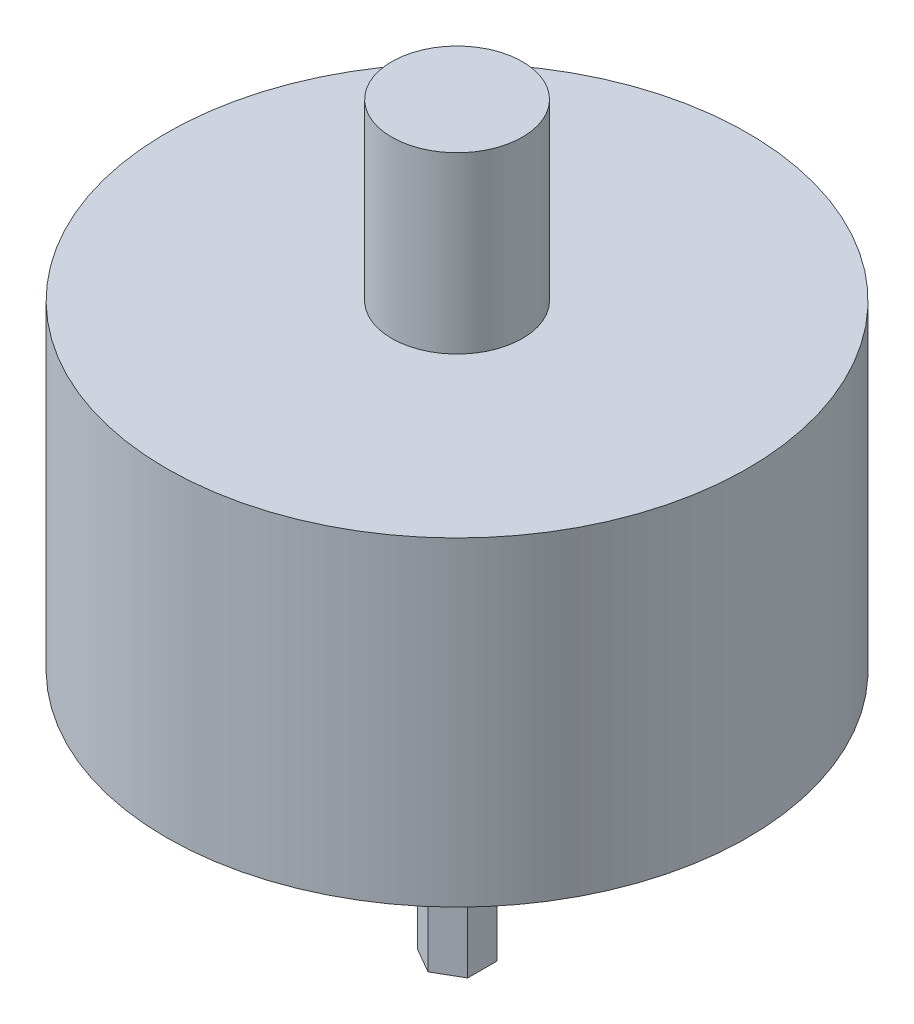
ISO-10303-21;
HEADER;
FILE_DESCRIPTION(('STEP AP214'),'2;1');
FILE_NAME('part.step','',(''),(''),'','','');
FILE_SCHEMA(('AUTOMOTIVE_DESIGN { 1 0 10303 214 1 1 1 1 }'));
ENDSEC;
DATA;
#1=APPLICATION_CONTEXT('core data for automotive mechanical design processes');
#2=APPLICATION_PROTOCOL_DEFINITION('international standard','automotive_design',2000,#1);
#3=PRODUCT_CONTEXT('',#1,'mechanical');
#4=PRODUCT('Part','Part','',(#3));
#5=PRODUCT_RELATED_PRODUCT_CATEGORY('part','',(#4));
#6=PRODUCT_DEFINITION_FORMATION('','',#4);
#7=PRODUCT_DEFINITION_CONTEXT('part definition',#1,'design');
#8=PRODUCT_DEFINITION('design','',#6,#7);
#9=PRODUCT_DEFINITION_SHAPE('','',#8);
#10=(LENGTH_UNIT() NAMED_UNIT(*) SI_UNIT(.MILLI.,.METRE.));
#11=(NAMED_UNIT(*) PLANE_ANGLE_UNIT() SI_UNIT($,.RADIAN.));
#12=(NAMED_UNIT(*) SI_UNIT($,.STERADIAN.) SOLID_ANGLE_UNIT());
#13=UNCERTAINTY_MEASURE_WITH_UNIT(LENGTH_MEASURE(1.E-05),#10,'distance_accuracy_value','');
#14=(GEOMETRIC_REPRESENTATION_CONTEXT(3) GLOBAL_UNCERTAINTY_ASSIGNED_CONTEXT((#13)) GLOBAL_UNIT_ASSIGNED_CONTEXT((#10,
#11,#12)) REPRESENTATION_CONTEXT('',''));
#15=CARTESIAN_POINT('',(0.,0.,0.));
#16=DIRECTION('',(0.,0.,1.));
#17=DIRECTION('',(1.,0.,0.));
#18=AXIS2_PLACEMENT_3D('',#15,#16,#17);
#19=CARTESIAN_POINT('',(0.866025403784438,8.5,-0.500000000000001));
#20=DIRECTION('',(-0.5,0.,0.866025403784439));
#21=DIRECTION('',(0.866025403784439,0.,0.5));
#22=AXIS2_PLACEMENT_3D('',#19,#20,#21);
#23=PLANE('',#22);
#24=DIRECTION('',(-0.866025403784439,0.,-0.5));
#25=VECTOR('',#24,1.);
#26=CARTESIAN_POINT('',(0.866025403784438,0.,-0.500000000000001));
#27=LINE('',#26,#25);
#28=CARTESIAN_POINT('',(0.866025403784438,0.,-0.500000000000001));
#29=VERTEX_POINT('',#28);
#30=CARTESIAN_POINT('',(0.,0.,-1.));
#31=VERTEX_POINT('',#30);
#32=EDGE_CURVE('E146',#29,#31,#27,.T.);
#33=ORIENTED_EDGE('',*,*,#32,.T.);
#34=DIRECTION('',(0.,-1.,0.));
#35=VECTOR('',#34,1.);
#36=CARTESIAN_POINT('',(0.,8.5,-1.));
#37=LINE('',#36,#35);
#38=CARTESIAN_POINT('',(0.,8.5,-1.));
#39=VERTEX_POINT('',#38);
#40=EDGE_CURVE('E48',#39,#31,#37,.T.);
#41=ORIENTED_EDGE('',*,*,#40,.F.);
#42=DIRECTION('',(-0.866025403784439,0.,-0.5));
#43=VECTOR('',#42,1.);
#44=CARTESIAN_POINT('',(0.866025403784438,8.5,-0.500000000000001));
#45=LINE('',#44,#43);
#46=CARTESIAN_POINT('',(0.866025403784438,8.5,-0.500000000000001));
#47=VERTEX_POINT('',#46);
#48=EDGE_CURVE('E136',#47,#39,#45,.T.);
#49=ORIENTED_EDGE('',*,*,#48,.F.);
#50=DIRECTION('',(0.,-1.,0.));
#51=VECTOR('',#50,1.);
#52=CARTESIAN_POINT('',(0.866025403784438,8.5,-0.500000000000001));
#53=LINE('',#52,#51);
#54=EDGE_CURVE('E145',#47,#29,#53,.T.);
#55=ORIENTED_EDGE('',*,*,#54,.T.);
#56=EDGE_LOOP('',(#33,#41,#49,#55));
#57=FACE_BOUND('',#56,.T.);
#58=ADVANCED_FACE('F45',(#57),#23,.F.);
#59=CARTESIAN_POINT('',(0.,8.5,-1.));
#60=DIRECTION('',(0.5,0.,0.866025403784438));
#61=DIRECTION('',(0.866025403784438,0.,-0.5));
#62=AXIS2_PLACEMENT_3D('',#59,#60,#61);
#63=PLANE('',#62);
#64=DIRECTION('',(-0.866025403784438,0.,0.5));
#65=VECTOR('',#64,1.);
#66=CARTESIAN_POINT('',(0.,0.,-1.));
#67=LINE('',#66,#65);
#68=CARTESIAN_POINT('',(-0.866025403784439,0.,-0.5));
#69=VERTEX_POINT('',#68);
#70=EDGE_CURVE('E150',#31,#69,#67,.T.);
#71=ORIENTED_EDGE('',*,*,#70,.T.);
#72=DIRECTION('',(0.,-1.,0.));
#73=VECTOR('',#72,1.);
#74=CARTESIAN_POINT('',(-0.866025403784439,8.5,-0.5));
#75=LINE('',#74,#73);
#76=CARTESIAN_POINT('',(-0.866025403784439,8.5,-0.5));
#77=VERTEX_POINT('',#76);
#78=EDGE_CURVE('E119',#77,#69,#75,.T.);
#79=ORIENTED_EDGE('',*,*,#78,.F.);
#80=DIRECTION('',(-0.866025403784438,0.,0.5));
#81=VECTOR('',#80,1.);
#82=CARTESIAN_POINT('',(0.,8.5,-1.));
#83=LINE('',#82,#81);
#84=EDGE_CURVE('E100',#39,#77,#83,.T.);
#85=ORIENTED_EDGE('',*,*,#84,.F.);
#86=ORIENTED_EDGE('',*,*,#40,.T.);
#87=EDGE_LOOP('',(#71,#79,#85,#86));
#88=FACE_BOUND('',#87,.T.);
#89=ADVANCED_FACE('F170',(#88),#63,.F.);
#90=CARTESIAN_POINT('',(-0.866025403784439,8.5,-0.5));
#91=DIRECTION('',(1.,0.,0.));
#92=DIRECTION('',(0.,0.,-1.));
#93=AXIS2_PLACEMENT_3D('',#90,#91,#92);
#94=PLANE('',#93);
#95=DIRECTION('',(0.,0.,1.));
#96=VECTOR('',#95,1.);
#97=CARTESIAN_POINT('',(-0.866025403784439,0.,-0.5));
#98=LINE('',#97,#96);
#99=CARTESIAN_POINT('',(-0.866025403784438,0.,0.5));
#100=VERTEX_POINT('',#99);
#101=EDGE_CURVE('E115',#69,#100,#98,.T.);
#102=ORIENTED_EDGE('',*,*,#101,.T.);
#103=DIRECTION('',(0.,-1.,0.));
#104=VECTOR('',#103,1.);
#105=CARTESIAN_POINT('',(-0.866025403784438,8.5,0.5));
#106=LINE('',#105,#104);
#107=CARTESIAN_POINT('',(-0.866025403784438,8.5,0.5));
#108=VERTEX_POINT('',#107);
#109=EDGE_CURVE('E108',#108,#100,#106,.T.);
#110=ORIENTED_EDGE('',*,*,#109,.F.);
#111=DIRECTION('',(0.,0.,1.));
#112=VECTOR('',#111,1.);
#113=CARTESIAN_POINT('',(-0.866025403784439,8.5,-0.5));
#114=LINE('',#113,#112);
#115=EDGE_CURVE('E113',#77,#108,#114,.T.);
#116=ORIENTED_EDGE('',*,*,#115,.F.);
#117=ORIENTED_EDGE('',*,*,#78,.T.);
#118=EDGE_LOOP('',(#102,#110,#116,#117));
#119=FACE_BOUND('',#118,.T.);
#120=ADVANCED_FACE('F110',(#119),#94,.F.);
#121=CARTESIAN_POINT('',(-0.866025403784438,8.5,0.5));
#122=DIRECTION('',(0.5,0.,-0.866025403784439));
#123=DIRECTION('',(-0.866025403784439,0.,-0.5));
#124=AXIS2_PLACEMENT_3D('',#121,#122,#123);
#125=PLANE('',#124);
#126=DIRECTION('',(0.866025403784439,0.,0.499999999999999));
#127=VECTOR('',#126,1.);
#128=CARTESIAN_POINT('',(-0.866025403784438,0.,0.5));
#129=LINE('',#128,#127);
#130=CARTESIAN_POINT('',(0.,0.,1.));
#131=VERTEX_POINT('',#130);
#132=EDGE_CURVE('E156',#100,#131,#129,.T.);
#133=ORIENTED_EDGE('',*,*,#132,.T.);
#134=DIRECTION('',(0.,-1.,0.));
#135=VECTOR('',#134,1.);
#136=CARTESIAN_POINT('',(0.,8.5,1.));
#137=LINE('',#136,#135);
#138=CARTESIAN_POINT('',(0.,8.5,1.));
#139=VERTEX_POINT('',#138);
#140=EDGE_CURVE('E120',#139,#131,#137,.T.);
#141=ORIENTED_EDGE('',*,*,#140,.F.);
#142=DIRECTION('',(0.866025403784439,0.,0.499999999999999));
#143=VECTOR('',#142,1.);
#144=CARTESIAN_POINT('',(-0.866025403784438,8.5,0.5));
#145=LINE('',#144,#143);
#146=EDGE_CURVE('E123',#108,#139,#145,.T.);
#147=ORIENTED_EDGE('',*,*,#146,.F.);
#148=ORIENTED_EDGE('',*,*,#109,.T.);
#149=EDGE_LOOP('',(#133,#141,#147,#148));
#150=FACE_BOUND('',#149,.T.);
#151=ADVANCED_FACE('F124',(#150),#125,.F.);
#152=CARTESIAN_POINT('',(0.,8.5,1.));
#153=DIRECTION('',(-0.5,0.,-0.866025403784439));
#154=DIRECTION('',(-0.866025403784439,0.,0.5));
#155=AXIS2_PLACEMENT_3D('',#152,#153,#154);
#156=PLANE('',#155);
#157=DIRECTION('',(0.866025403784439,0.,-0.5));
#158=VECTOR('',#157,1.);
#159=CARTESIAN_POINT('',(0.,0.,1.));
#160=LINE('',#159,#158);
#161=CARTESIAN_POINT('',(0.866025403784438,0.,0.500000000000001));
#162=VERTEX_POINT('',#161);
#163=EDGE_CURVE('E85',#131,#162,#160,.T.);
#164=ORIENTED_EDGE('',*,*,#163,.T.);
#165=DIRECTION('',(0.,-1.,0.));
#166=VECTOR('',#165,1.);
#167=CARTESIAN_POINT('',(0.866025403784438,8.5,0.500000000000001));
#168=LINE('',#167,#166);
#169=CARTESIAN_POINT('',(0.866025403784438,8.5,0.500000000000001));
#170=VERTEX_POINT('',#169);
#171=EDGE_CURVE('E63',#170,#162,#168,.T.);
#172=ORIENTED_EDGE('',*,*,#171,.F.);
#173=DIRECTION('',(0.866025403784439,0.,-0.5));
#174=VECTOR('',#173,1.);
#175=CARTESIAN_POINT('',(0.,8.5,1.));
#176=LINE('',#175,#174);
#177=EDGE_CURVE('E128',#139,#170,#176,.T.);
#178=ORIENTED_EDGE('',*,*,#177,.F.);
#179=ORIENTED_EDGE('',*,*,#140,.T.);
#180=EDGE_LOOP('',(#164,#172,#178,#179));
#181=FACE_BOUND('',#180,.T.);
#182=ADVANCED_FACE('F176',(#181),#156,.F.);
#183=CARTESIAN_POINT('',(0.866025403784438,8.5,0.500000000000001));
#184=DIRECTION('',(-1.,0.,0.));
#185=DIRECTION('',(0.,0.,1.));
#186=AXIS2_PLACEMENT_3D('',#183,#184,#185);
#187=PLANE('',#186);
#188=DIRECTION('',(0.,0.,-1.));
#189=VECTOR('',#188,1.);
#190=CARTESIAN_POINT('',(0.866025403784438,0.,0.500000000000001));
#191=LINE('',#190,#189);
#192=EDGE_CURVE('E91',#162,#29,#191,.T.);
#193=ORIENTED_EDGE('',*,*,#192,.T.);
#194=ORIENTED_EDGE('',*,*,#54,.F.);
#195=DIRECTION('',(0.,0.,-1.));
#196=VECTOR('',#195,1.);
#197=CARTESIAN_POINT('',(0.866025403784438,8.5,0.500000000000001));
#198=LINE('',#197,#196);
#199=EDGE_CURVE('E142',#170,#47,#198,.T.);
#200=ORIENTED_EDGE('',*,*,#199,.F.);
#201=ORIENTED_EDGE('',*,*,#171,.T.);
#202=EDGE_LOOP('',(#193,#194,#200,#201));
#203=FACE_BOUND('',#202,.T.);
#204=ADVANCED_FACE('F177',(#203),#187,.F.);
#205=CARTESIAN_POINT('',(0.,0.,0.));
#206=DIRECTION('',(0.,1.,0.));
#207=DIRECTION('',(0.,0.,1.));
#208=AXIS2_PLACEMENT_3D('',#205,#206,#207);
#209=PLANE('',#208);
#210=ORIENTED_EDGE('',*,*,#32,.F.);
#211=ORIENTED_EDGE('',*,*,#192,.F.);
#212=ORIENTED_EDGE('',*,*,#163,.F.);
#213=ORIENTED_EDGE('',*,*,#132,.F.);
#214=ORIENTED_EDGE('',*,*,#101,.F.);
#215=ORIENTED_EDGE('',*,*,#70,.F.);
#216=EDGE_LOOP('',(#210,#211,#212,#213,#214,#215));
#217=FACE_BOUND('',#216,.T.);
#218=ADVANCED_FACE('F175',(#217),#209,.F.);
#219=CARTESIAN_POINT('',(0.,8.5,0.));
#220=DIRECTION('',(0.,1.,0.));
#221=DIRECTION('',(0.,0.,1.));
#222=AXIS2_PLACEMENT_3D('',#219,#220,#221);
#223=PLANE('',#222);
#224=CARTESIAN_POINT('',(0.,8.5,0.));
#225=DIRECTION('',(0.,1.,0.));
#226=DIRECTION('',(0.,0.,1.));
#227=AXIS2_PLACEMENT_3D('',#224,#225,#226);
#228=CIRCLE('',#227,10.);
#229=CARTESIAN_POINT('',(0.,8.5,10.));
#230=VERTEX_POINT('',#229);
#231=EDGE_CURVE('E272',#230,#230,#228,.T.);
#232=ORIENTED_EDGE('',*,*,#231,.F.);
#233=EDGE_LOOP('',(#232));
#234=FACE_BOUND('',#233,.T.);
#235=ORIENTED_EDGE('',*,*,#199,.T.);
#236=ORIENTED_EDGE('',*,*,#48,.T.);
#237=ORIENTED_EDGE('',*,*,#84,.T.);
#238=ORIENTED_EDGE('',*,*,#115,.T.);
#239=ORIENTED_EDGE('',*,*,#146,.T.);
#240=ORIENTED_EDGE('',*,*,#177,.T.);
#241=EDGE_LOOP('',(#235,#236,#237,#238,#239,#240));
#242=FACE_BOUND('',#241,.T.);
#243=ADVANCED_FACE('F131',(#234,#242),#223,.F.);
#244=CARTESIAN_POINT('',(0.,19.5,0.));
#245=DIRECTION('',(0.,-1.,0.));
#246=DIRECTION('',(0.,0.,-1.));
#247=AXIS2_PLACEMENT_3D('',#244,#245,#246);
#248=CYLINDRICAL_SURFACE('',#247,10.);
#249=CARTESIAN_POINT('',(0.,19.5,0.));
#250=DIRECTION('',(0.,1.,0.));
#251=DIRECTION('',(0.,0.,1.));
#252=AXIS2_PLACEMENT_3D('',#249,#250,#251);
#253=CIRCLE('',#252,10.);
#254=CARTESIAN_POINT('',(0.,19.5,10.));
#255=VERTEX_POINT('',#254);
#256=EDGE_CURVE('E151',#255,#255,#253,.T.);
#257=ORIENTED_EDGE('',*,*,#256,.F.);
#258=EDGE_LOOP('',(#257));
#259=FACE_BOUND('',#258,.T.);
#260=ORIENTED_EDGE('',*,*,#231,.T.);
#261=EDGE_LOOP('',(#260));
#262=FACE_BOUND('',#261,.T.);
#263=ADVANCED_FACE('F225',(#259,#262),#248,.T.);
#264=CARTESIAN_POINT('',(0.,19.5,0.));
#265=DIRECTION('',(0.,1.,0.));
#266=DIRECTION('',(0.,0.,1.));
#267=AXIS2_PLACEMENT_3D('',#264,#265,#266);
#268=PLANE('',#267);
#269=CARTESIAN_POINT('',(0.,19.5,0.));
#270=DIRECTION('',(0.,1.,0.));
#271=DIRECTION('',(0.,0.,1.));
#272=AXIS2_PLACEMENT_3D('',#269,#270,#271);
#273=CIRCLE('',#272,2.25);
#274=CARTESIAN_POINT('',(0.,19.5,2.25));
#275=VERTEX_POINT('',#274);
#276=EDGE_CURVE('E11',#275,#275,#273,.T.);
#277=ORIENTED_EDGE('',*,*,#276,.F.);
#278=EDGE_LOOP('',(#277));
#279=FACE_BOUND('',#278,.T.);
#280=ORIENTED_EDGE('',*,*,#256,.T.);
#281=EDGE_LOOP('',(#280));
#282=FACE_BOUND('',#281,.T.);
#283=ADVANCED_FACE('F235',(#279,#282),#268,.T.);
#284=CARTESIAN_POINT('',(0.,25.5,0.));
#285=DIRECTION('',(0.,-1.,0.));
#286=DIRECTION('',(0.,0.,-1.));
#287=AXIS2_PLACEMENT_3D('',#284,#285,#286);
#288=CYLINDRICAL_SURFACE('',#287,2.25);
#289=CARTESIAN_POINT('',(0.,25.5,0.));
#290=DIRECTION('',(0.,1.,0.));
#291=DIRECTION('',(0.,0.,1.));
#292=AXIS2_PLACEMENT_3D('',#289,#290,#291);
#293=CIRCLE('',#292,2.25);
#294=CARTESIAN_POINT('',(0.,25.5,2.25));
#295=VERTEX_POINT('',#294);
#296=EDGE_CURVE('E270',#295,#295,#293,.T.);
#297=ORIENTED_EDGE('',*,*,#296,.F.);
#298=EDGE_LOOP('',(#297));
#299=FACE_BOUND('',#298,.T.);
#300=ORIENTED_EDGE('',*,*,#276,.T.);
#301=EDGE_LOOP('',(#300));
#302=FACE_BOUND('',#301,.T.);
#303=ADVANCED_FACE('F245',(#299,#302),#288,.T.);
#304=CARTESIAN_POINT('',(0.,25.5,0.));
#305=DIRECTION('',(0.,1.,0.));
#306=DIRECTION('',(0.,0.,1.));
#307=AXIS2_PLACEMENT_3D('',#304,#305,#306);
#308=PLANE('',#307);
#309=ORIENTED_EDGE('',*,*,#296,.T.);
#310=EDGE_LOOP('',(#309));
#311=FACE_BOUND('',#310,.T.);
#312=ADVANCED_FACE('F255',(#311),#308,.T.);
#313=CLOSED_SHELL('',(#58,#89,#120,#151,#182,#204,#218,#243,#263,#283,#303,#312));
#314=MANIFOLD_SOLID_BREP('B2',#313);
#315=ADVANCED_BREP_SHAPE_REPRESENTATION('',(#18,#314),#14);
#316=SHAPE_DEFINITION_REPRESENTATION(#9,#315);
ENDSEC;
END-ISO-10303-21;
